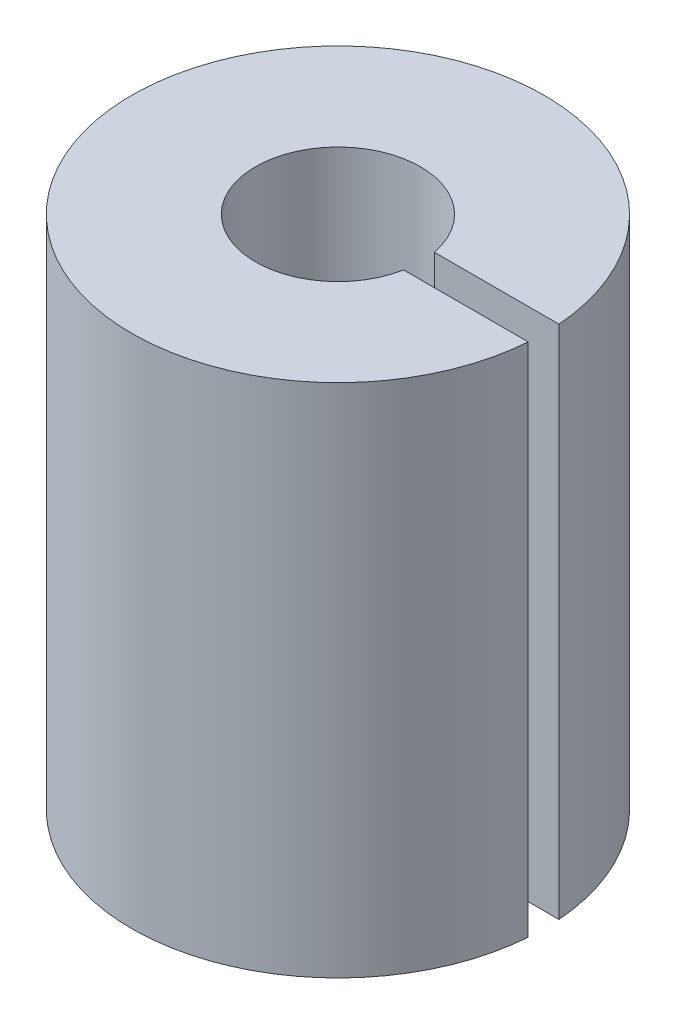
ISO-10303-21;
HEADER;
FILE_DESCRIPTION(('STEP AP214'),'2;1');
FILE_NAME('part.step','',(''),(''),'','','');
FILE_SCHEMA(('AUTOMOTIVE_DESIGN { 1 0 10303 214 1 1 1 1 }'));
ENDSEC;
DATA;
#1=APPLICATION_CONTEXT('core data for automotive mechanical design processes');
#2=APPLICATION_PROTOCOL_DEFINITION('international standard','automotive_design',2000,#1);
#3=PRODUCT_CONTEXT('',#1,'mechanical');
#4=PRODUCT('Part','Part','',(#3));
#5=PRODUCT_RELATED_PRODUCT_CATEGORY('part','',(#4));
#6=PRODUCT_DEFINITION_FORMATION('','',#4);
#7=PRODUCT_DEFINITION_CONTEXT('part definition',#1,'design');
#8=PRODUCT_DEFINITION('design','',#6,#7);
#9=PRODUCT_DEFINITION_SHAPE('','',#8);
#10=(LENGTH_UNIT() NAMED_UNIT(*) SI_UNIT(.MILLI.,.METRE.));
#11=(NAMED_UNIT(*) PLANE_ANGLE_UNIT() SI_UNIT($,.RADIAN.));
#12=(NAMED_UNIT(*) SI_UNIT($,.STERADIAN.) SOLID_ANGLE_UNIT());
#13=UNCERTAINTY_MEASURE_WITH_UNIT(LENGTH_MEASURE(1.E-05),#10,'distance_accuracy_value','');
#14=(GEOMETRIC_REPRESENTATION_CONTEXT(3) GLOBAL_UNCERTAINTY_ASSIGNED_CONTEXT((#13)) GLOBAL_UNIT_ASSIGNED_CONTEXT((#10,
#11,#12)) REPRESENTATION_CONTEXT('',''));
#15=CARTESIAN_POINT('',(0.,0.,0.));
#16=DIRECTION('',(0.,0.,1.));
#17=DIRECTION('',(1.,0.,0.));
#18=AXIS2_PLACEMENT_3D('',#15,#16,#17);
#19=CARTESIAN_POINT('',(0.,25.,0.));
#20=DIRECTION('',(0.,-1.,0.));
#21=DIRECTION('',(0.,0.,-1.));
#22=AXIS2_PLACEMENT_3D('',#19,#20,#21);
#23=CYLINDRICAL_SURFACE('',#22,10.);
#24=CARTESIAN_POINT('',(0.,0.,0.));
#25=DIRECTION('',(0.,1.,0.));
#26=DIRECTION('',(0.,0.,1.));
#27=AXIS2_PLACEMENT_3D('',#24,#25,#26);
#28=CIRCLE('',#27,10.);
#29=CARTESIAN_POINT('',(9.97224625404384,0.,-0.744516385789201));
#30=VERTEX_POINT('',#29);
#31=CARTESIAN_POINT('',(9.97224625404384,0.,0.744516385789201));
#32=VERTEX_POINT('',#31);
#33=EDGE_CURVE('E104',#30,#32,#28,.T.);
#34=ORIENTED_EDGE('',*,*,#33,.T.);
#35=DIRECTION('',(0.,-1.,0.));
#36=VECTOR('',#35,1.);
#37=CARTESIAN_POINT('',(9.97224625404384,25.,0.744516385789201));
#38=LINE('',#37,#36);
#39=CARTESIAN_POINT('',(9.97224625404384,25.,0.744516385789201));
#40=VERTEX_POINT('',#39);
#41=EDGE_CURVE('E88',#32,#40,#38,.F.);
#42=ORIENTED_EDGE('',*,*,#41,.T.);
#43=CARTESIAN_POINT('',(0.,25.,0.));
#44=DIRECTION('',(0.,1.,0.));
#45=DIRECTION('',(0.,0.,1.));
#46=AXIS2_PLACEMENT_3D('',#43,#44,#45);
#47=CIRCLE('',#46,10.);
#48=CARTESIAN_POINT('',(9.97224625404384,25.,-0.744516385789201));
#49=VERTEX_POINT('',#48);
#50=EDGE_CURVE('E110',#49,#40,#47,.T.);
#51=ORIENTED_EDGE('',*,*,#50,.F.);
#52=DIRECTION('',(0.,-1.,0.));
#53=VECTOR('',#52,1.);
#54=CARTESIAN_POINT('',(9.97224625404384,25.,-0.744516385789201));
#55=LINE('',#54,#53);
#56=EDGE_CURVE('E109',#49,#30,#55,.T.);
#57=ORIENTED_EDGE('',*,*,#56,.T.);
#58=EDGE_LOOP('',(#34,#42,#51,#57));
#59=FACE_BOUND('',#58,.T.);
#60=ADVANCED_FACE('F39',(#59),#23,.T.);
#61=CARTESIAN_POINT('',(0.,25.,0.));
#62=DIRECTION('',(0.,1.,0.));
#63=DIRECTION('',(0.,0.,1.));
#64=AXIS2_PLACEMENT_3D('',#61,#62,#63);
#65=PLANE('',#64);
#66=DIRECTION('',(1.,0.,0.));
#67=VECTOR('',#66,1.);
#68=CARTESIAN_POINT('',(0.,25.,0.744516385789201));
#69=LINE('',#68,#67);
#70=CARTESIAN_POINT('',(3.93010118842904,25.,0.744516385789201));
#71=VERTEX_POINT('',#70);
#72=EDGE_CURVE('E91',#71,#40,#69,.T.);
#73=ORIENTED_EDGE('',*,*,#72,.F.);
#74=CARTESIAN_POINT('',(0.,25.,0.));
#75=DIRECTION('',(0.,1.,0.));
#76=DIRECTION('',(0.,0.,1.));
#77=AXIS2_PLACEMENT_3D('',#74,#75,#76);
#78=CIRCLE('',#77,4.);
#79=CARTESIAN_POINT('',(3.93010118842904,25.,-0.744516385789201));
#80=VERTEX_POINT('',#79);
#81=EDGE_CURVE('E115',#80,#71,#78,.T.);
#82=ORIENTED_EDGE('',*,*,#81,.F.);
#83=DIRECTION('',(-1.,0.,0.));
#84=VECTOR('',#83,1.);
#85=CARTESIAN_POINT('',(0.,25.,-0.744516385789201));
#86=LINE('',#85,#84);
#87=EDGE_CURVE('E141',#49,#80,#86,.T.);
#88=ORIENTED_EDGE('',*,*,#87,.F.);
#89=ORIENTED_EDGE('',*,*,#50,.T.);
#90=EDGE_LOOP('',(#73,#82,#88,#89));
#91=FACE_BOUND('',#90,.T.);
#92=ADVANCED_FACE('F147',(#91),#65,.T.);
#93=CARTESIAN_POINT('',(0.,0.,0.));
#94=DIRECTION('',(0.,1.,0.));
#95=DIRECTION('',(0.,0.,1.));
#96=AXIS2_PLACEMENT_3D('',#93,#94,#95);
#97=PLANE('',#96);
#98=CARTESIAN_POINT('',(0.,0.,0.));
#99=DIRECTION('',(0.,-1.,0.));
#100=DIRECTION('',(0.,0.,-1.));
#101=AXIS2_PLACEMENT_3D('',#98,#99,#100);
#102=CIRCLE('',#101,2.5);
#103=CARTESIAN_POINT('',(2.38656559752532,0.,0.744516385789201));
#104=VERTEX_POINT('',#103);
#105=CARTESIAN_POINT('',(2.38656559752532,0.,-0.744516385789201));
#106=VERTEX_POINT('',#105);
#107=EDGE_CURVE('E96',#104,#106,#102,.T.);
#108=ORIENTED_EDGE('',*,*,#107,.F.);
#109=DIRECTION('',(1.,0.,0.));
#110=VECTOR('',#109,1.);
#111=CARTESIAN_POINT('',(0.,0.,0.744516385789201));
#112=LINE('',#111,#110);
#113=EDGE_CURVE('E53',#104,#32,#112,.T.);
#114=ORIENTED_EDGE('',*,*,#113,.T.);
#115=ORIENTED_EDGE('',*,*,#33,.F.);
#116=DIRECTION('',(-1.,0.,0.));
#117=VECTOR('',#116,1.);
#118=CARTESIAN_POINT('',(0.,0.,-0.744516385789201));
#119=LINE('',#118,#117);
#120=EDGE_CURVE('E106',#30,#106,#119,.T.);
#121=ORIENTED_EDGE('',*,*,#120,.T.);
#122=EDGE_LOOP('',(#108,#114,#115,#121));
#123=FACE_BOUND('',#122,.T.);
#124=ADVANCED_FACE('F102',(#123),#97,.F.);
#125=CARTESIAN_POINT('',(0.,12.5,0.));
#126=DIRECTION('',(0.,1.,0.));
#127=DIRECTION('',(0.,0.,1.));
#128=AXIS2_PLACEMENT_3D('',#125,#126,#127);
#129=CYLINDRICAL_SURFACE('',#128,4.);
#130=ORIENTED_EDGE('',*,*,#81,.T.);
#131=DIRECTION('',(0.,1.,0.));
#132=VECTOR('',#131,1.);
#133=CARTESIAN_POINT('',(3.93010118842904,12.5,0.744516385789201));
#134=LINE('',#133,#132);
#135=CARTESIAN_POINT('',(3.93010118842904,12.5,0.744516385789201));
#136=VERTEX_POINT('',#135);
#137=EDGE_CURVE('E97',#71,#136,#134,.F.);
#138=ORIENTED_EDGE('',*,*,#137,.T.);
#139=CARTESIAN_POINT('',(0.,12.5,0.));
#140=DIRECTION('',(0.,1.,0.));
#141=DIRECTION('',(0.,0.,1.));
#142=AXIS2_PLACEMENT_3D('',#139,#140,#141);
#143=CIRCLE('',#142,4.);
#144=CARTESIAN_POINT('',(3.93010118842904,12.5,-0.744516385789201));
#145=VERTEX_POINT('',#144);
#146=EDGE_CURVE('E111',#145,#136,#143,.T.);
#147=ORIENTED_EDGE('',*,*,#146,.F.);
#148=DIRECTION('',(0.,1.,0.));
#149=VECTOR('',#148,1.);
#150=CARTESIAN_POINT('',(3.93010118842904,12.5,-0.744516385789201));
#151=LINE('',#150,#149);
#152=EDGE_CURVE('E136',#145,#80,#151,.T.);
#153=ORIENTED_EDGE('',*,*,#152,.T.);
#154=EDGE_LOOP('',(#130,#138,#147,#153));
#155=FACE_BOUND('',#154,.T.);
#156=ADVANCED_FACE('F149',(#155),#129,.F.);
#157=CARTESIAN_POINT('',(0.,12.5,0.));
#158=DIRECTION('',(0.,1.,0.));
#159=DIRECTION('',(0.,0.,1.));
#160=AXIS2_PLACEMENT_3D('',#157,#158,#159);
#161=PLANE('',#160);
#162=DIRECTION('',(1.,0.,0.));
#163=VECTOR('',#162,1.);
#164=CARTESIAN_POINT('',(0.,12.5,0.744516385789201));
#165=LINE('',#164,#163);
#166=CARTESIAN_POINT('',(2.38656559752532,12.5,0.744516385789201));
#167=VERTEX_POINT('',#166);
#168=EDGE_CURVE('E127',#167,#136,#165,.T.);
#169=ORIENTED_EDGE('',*,*,#168,.F.);
#170=CARTESIAN_POINT('',(0.,12.5,0.));
#171=DIRECTION('',(0.,-1.,0.));
#172=DIRECTION('',(0.,0.,-1.));
#173=AXIS2_PLACEMENT_3D('',#170,#171,#172);
#174=CIRCLE('',#173,2.5);
#175=CARTESIAN_POINT('',(2.38656559752532,12.5,-0.744516385789201));
#176=VERTEX_POINT('',#175);
#177=EDGE_CURVE('E122',#167,#176,#174,.T.);
#178=ORIENTED_EDGE('',*,*,#177,.T.);
#179=DIRECTION('',(-1.,0.,0.));
#180=VECTOR('',#179,1.);
#181=CARTESIAN_POINT('',(0.,12.5,-0.744516385789201));
#182=LINE('',#181,#180);
#183=EDGE_CURVE('E60',#145,#176,#182,.T.);
#184=ORIENTED_EDGE('',*,*,#183,.F.);
#185=ORIENTED_EDGE('',*,*,#146,.T.);
#186=EDGE_LOOP('',(#169,#178,#184,#185));
#187=FACE_BOUND('',#186,.T.);
#188=ADVANCED_FACE('F125',(#187),#161,.T.);
#189=CARTESIAN_POINT('',(0.,12.5,0.));
#190=DIRECTION('',(0.,-1.,0.));
#191=DIRECTION('',(0.,0.,-1.));
#192=AXIS2_PLACEMENT_3D('',#189,#190,#191);
#193=CYLINDRICAL_SURFACE('',#192,2.5);
#194=ORIENTED_EDGE('',*,*,#177,.F.);
#195=DIRECTION('',(0.,-1.,0.));
#196=VECTOR('',#195,1.);
#197=CARTESIAN_POINT('',(2.38656559752532,12.5,0.744516385789201));
#198=LINE('',#197,#196);
#199=EDGE_CURVE('E11',#167,#104,#198,.T.);
#200=ORIENTED_EDGE('',*,*,#199,.T.);
#201=ORIENTED_EDGE('',*,*,#107,.T.);
#202=DIRECTION('',(0.,-1.,0.));
#203=VECTOR('',#202,1.);
#204=CARTESIAN_POINT('',(2.38656559752532,12.5,-0.744516385789201));
#205=LINE('',#204,#203);
#206=EDGE_CURVE('E46',#106,#176,#205,.F.);
#207=ORIENTED_EDGE('',*,*,#206,.T.);
#208=EDGE_LOOP('',(#194,#200,#201,#207));
#209=FACE_BOUND('',#208,.T.);
#210=ADVANCED_FACE('F121',(#209),#193,.F.);
#211=CARTESIAN_POINT('',(0.,0.,-0.744516385789201));
#212=DIRECTION('',(0.,0.,-1.));
#213=DIRECTION('',(-1.,0.,0.));
#214=AXIS2_PLACEMENT_3D('',#211,#212,#213);
#215=PLANE('',#214);
#216=ORIENTED_EDGE('',*,*,#87,.T.);
#217=ORIENTED_EDGE('',*,*,#152,.F.);
#218=ORIENTED_EDGE('',*,*,#183,.T.);
#219=ORIENTED_EDGE('',*,*,#206,.F.);
#220=ORIENTED_EDGE('',*,*,#120,.F.);
#221=ORIENTED_EDGE('',*,*,#56,.F.);
#222=EDGE_LOOP('',(#216,#217,#218,#219,#220,#221));
#223=FACE_BOUND('',#222,.T.);
#224=ADVANCED_FACE('F143',(#223),#215,.F.);
#225=CARTESIAN_POINT('',(0.,0.,0.744516385789201));
#226=DIRECTION('',(0.,0.,1.));
#227=DIRECTION('',(1.,0.,0.));
#228=AXIS2_PLACEMENT_3D('',#225,#226,#227);
#229=PLANE('',#228);
#230=ORIENTED_EDGE('',*,*,#113,.F.);
#231=ORIENTED_EDGE('',*,*,#199,.F.);
#232=ORIENTED_EDGE('',*,*,#168,.T.);
#233=ORIENTED_EDGE('',*,*,#137,.F.);
#234=ORIENTED_EDGE('',*,*,#72,.T.);
#235=ORIENTED_EDGE('',*,*,#41,.F.);
#236=EDGE_LOOP('',(#230,#231,#232,#233,#234,#235));
#237=FACE_BOUND('',#236,.T.);
#238=ADVANCED_FACE('F89',(#237),#229,.F.);
#239=CLOSED_SHELL('',(#60,#92,#124,#156,#188,#210,#224,#238));
#240=MANIFOLD_SOLID_BREP('B2',#239);
#241=ADVANCED_BREP_SHAPE_REPRESENTATION('',(#18,#240),#14);
#242=SHAPE_DEFINITION_REPRESENTATION(#9,#241);
ENDSEC;
END-ISO-10303-21;
